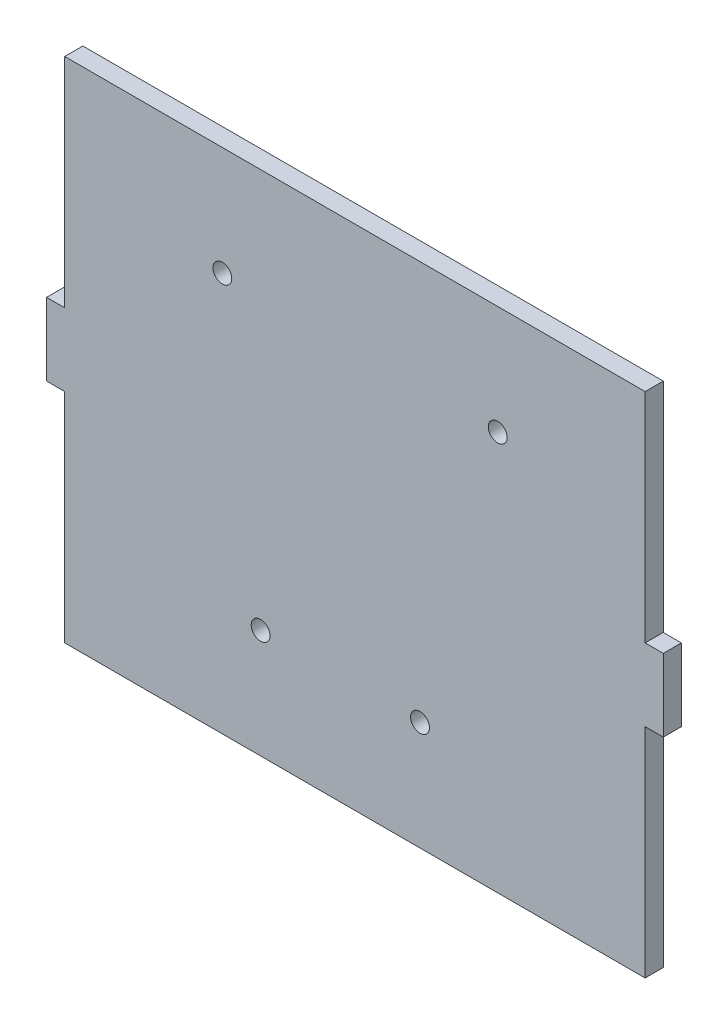
ISO-10303-21;
HEADER;
FILE_DESCRIPTION(('STEP AP214'),'2;1');
FILE_NAME('part.step','',(''),(''),'','','');
FILE_SCHEMA(('AUTOMOTIVE_DESIGN { 1 0 10303 214 1 1 1 1 }'));
ENDSEC;
DATA;
#1=APPLICATION_CONTEXT('core data for automotive mechanical design processes');
#2=APPLICATION_PROTOCOL_DEFINITION('international standard','automotive_design',2000,#1);
#3=PRODUCT_CONTEXT('',#1,'mechanical');
#4=PRODUCT('Part','Part','',(#3));
#5=PRODUCT_RELATED_PRODUCT_CATEGORY('part','',(#4));
#6=PRODUCT_DEFINITION_FORMATION('','',#4);
#7=PRODUCT_DEFINITION_CONTEXT('part definition',#1,'design');
#8=PRODUCT_DEFINITION('design','',#6,#7);
#9=PRODUCT_DEFINITION_SHAPE('','',#8);
#10=(LENGTH_UNIT() NAMED_UNIT(*) SI_UNIT(.MILLI.,.METRE.));
#11=(NAMED_UNIT(*) PLANE_ANGLE_UNIT() SI_UNIT($,.RADIAN.));
#12=(NAMED_UNIT(*) SI_UNIT($,.STERADIAN.) SOLID_ANGLE_UNIT());
#13=UNCERTAINTY_MEASURE_WITH_UNIT(LENGTH_MEASURE(1.E-05),#10,'distance_accuracy_value','');
#14=(GEOMETRIC_REPRESENTATION_CONTEXT(3) GLOBAL_UNCERTAINTY_ASSIGNED_CONTEXT((#13)) GLOBAL_UNIT_ASSIGNED_CONTEXT((#10,
#11,#12)) REPRESENTATION_CONTEXT('',''));
#15=CARTESIAN_POINT('',(0.,0.,0.));
#16=DIRECTION('',(0.,0.,1.));
#17=DIRECTION('',(1.,0.,0.));
#18=AXIS2_PLACEMENT_3D('',#15,#16,#17);
#19=CARTESIAN_POINT('',(101.6,0.,3.175));
#20=DIRECTION('',(-1.,0.,0.));
#21=DIRECTION('',(0.,0.,1.));
#22=AXIS2_PLACEMENT_3D('',#19,#20,#21);
#23=PLANE('',#22);
#24=DIRECTION('',(0.,0.,1.));
#25=VECTOR('',#24,1.);
#26=CARTESIAN_POINT('',(101.6,50.8,0.));
#27=LINE('',#26,#25);
#28=CARTESIAN_POINT('',(101.6,50.8,0.));
#29=VERTEX_POINT('',#28);
#30=CARTESIAN_POINT('',(101.6,50.8,3.175));
#31=VERTEX_POINT('',#30);
#32=EDGE_CURVE('E132',#29,#31,#27,.T.);
#33=ORIENTED_EDGE('',*,*,#32,.F.);
#34=DIRECTION('',(0.,1.,0.));
#35=VECTOR('',#34,1.);
#36=CARTESIAN_POINT('',(101.6,0.,0.));
#37=LINE('',#36,#35);
#38=CARTESIAN_POINT('',(101.6,88.9,0.));
#39=VERTEX_POINT('',#38);
#40=EDGE_CURVE('E146',#29,#39,#37,.T.);
#41=ORIENTED_EDGE('',*,*,#40,.T.);
#42=DIRECTION('',(0.,0.,-1.));
#43=VECTOR('',#42,1.);
#44=CARTESIAN_POINT('',(101.6,88.9,3.175));
#45=LINE('',#44,#43);
#46=CARTESIAN_POINT('',(101.6,88.9,3.175));
#47=VERTEX_POINT('',#46);
#48=EDGE_CURVE('E175',#47,#39,#45,.T.);
#49=ORIENTED_EDGE('',*,*,#48,.F.);
#50=DIRECTION('',(0.,1.,0.));
#51=VECTOR('',#50,1.);
#52=CARTESIAN_POINT('',(101.6,0.,3.175));
#53=LINE('',#52,#51);
#54=EDGE_CURVE('E148',#31,#47,#53,.T.);
#55=ORIENTED_EDGE('',*,*,#54,.F.);
#56=EDGE_LOOP('',(#33,#41,#49,#55));
#57=FACE_BOUND('',#56,.T.);
#58=ADVANCED_FACE('F39',(#57),#23,.F.);
#59=CARTESIAN_POINT('',(0.,0.,3.175));
#60=DIRECTION('',(1.,0.,0.));
#61=DIRECTION('',(0.,1.,0.));
#62=AXIS2_PLACEMENT_3D('',#59,#60,#61);
#63=PLANE('',#62);
#64=DIRECTION('',(0.,0.,1.));
#65=VECTOR('',#64,1.);
#66=CARTESIAN_POINT('',(0.,38.1,0.));
#67=LINE('',#66,#65);
#68=CARTESIAN_POINT('',(0.,38.1,0.));
#69=VERTEX_POINT('',#68);
#70=CARTESIAN_POINT('',(0.,38.1,3.175));
#71=VERTEX_POINT('',#70);
#72=EDGE_CURVE('E237',#69,#71,#67,.T.);
#73=ORIENTED_EDGE('',*,*,#72,.F.);
#74=DIRECTION('',(0.,-1.,0.));
#75=VECTOR('',#74,1.);
#76=CARTESIAN_POINT('',(0.,0.,0.));
#77=LINE('',#76,#75);
#78=CARTESIAN_POINT('',(0.,0.,0.));
#79=VERTEX_POINT('',#78);
#80=EDGE_CURVE('E240',#69,#79,#77,.T.);
#81=ORIENTED_EDGE('',*,*,#80,.T.);
#82=DIRECTION('',(0.,0.,-1.));
#83=VECTOR('',#82,1.);
#84=CARTESIAN_POINT('',(0.,0.,3.175));
#85=LINE('',#84,#83);
#86=CARTESIAN_POINT('',(0.,0.,3.175));
#87=VERTEX_POINT('',#86);
#88=EDGE_CURVE('E11',#87,#79,#85,.T.);
#89=ORIENTED_EDGE('',*,*,#88,.F.);
#90=DIRECTION('',(0.,-1.,0.));
#91=VECTOR('',#90,1.);
#92=CARTESIAN_POINT('',(0.,0.,3.175));
#93=LINE('',#92,#91);
#94=EDGE_CURVE('E170',#71,#87,#93,.T.);
#95=ORIENTED_EDGE('',*,*,#94,.F.);
#96=EDGE_LOOP('',(#73,#81,#89,#95));
#97=FACE_BOUND('',#96,.T.);
#98=ADVANCED_FACE('F266',(#97),#63,.F.);
#99=CARTESIAN_POINT('',(0.,88.9,0.));
#100=VERTEX_POINT('',#99);
#101=CARTESIAN_POINT('',(0.,50.8,0.));
#102=VERTEX_POINT('',#101);
#103=EDGE_CURVE('E164',#100,#102,#77,.T.);
#104=ORIENTED_EDGE('',*,*,#103,.T.);
#105=DIRECTION('',(0.,0.,1.));
#106=VECTOR('',#105,1.);
#107=CARTESIAN_POINT('',(0.,50.8,0.));
#108=LINE('',#107,#106);
#109=CARTESIAN_POINT('',(0.,50.8,3.175));
#110=VERTEX_POINT('',#109);
#111=EDGE_CURVE('E227',#102,#110,#108,.T.);
#112=ORIENTED_EDGE('',*,*,#111,.T.);
#113=CARTESIAN_POINT('',(0.,88.9,3.175));
#114=VERTEX_POINT('',#113);
#115=EDGE_CURVE('E249',#114,#110,#93,.T.);
#116=ORIENTED_EDGE('',*,*,#115,.F.);
#117=DIRECTION('',(0.,0.,-1.));
#118=VECTOR('',#117,1.);
#119=CARTESIAN_POINT('',(0.,88.9,3.175));
#120=LINE('',#119,#118);
#121=EDGE_CURVE('E171',#114,#100,#120,.T.);
#122=ORIENTED_EDGE('',*,*,#121,.T.);
#123=EDGE_LOOP('',(#104,#112,#116,#122));
#124=FACE_BOUND('',#123,.T.);
#125=ADVANCED_FACE('F41',(#124),#63,.F.);
#126=CARTESIAN_POINT('',(0.,0.,3.175));
#127=DIRECTION('',(0.,1.,0.));
#128=DIRECTION('',(0.,0.,1.));
#129=AXIS2_PLACEMENT_3D('',#126,#127,#128);
#130=PLANE('',#129);
#131=DIRECTION('',(1.,0.,0.));
#132=VECTOR('',#131,1.);
#133=CARTESIAN_POINT('',(0.,0.,0.));
#134=LINE('',#133,#132);
#135=CARTESIAN_POINT('',(101.6,0.,0.));
#136=VERTEX_POINT('',#135);
#137=EDGE_CURVE('E159',#79,#136,#134,.T.);
#138=ORIENTED_EDGE('',*,*,#137,.T.);
#139=DIRECTION('',(0.,0.,-1.));
#140=VECTOR('',#139,1.);
#141=CARTESIAN_POINT('',(101.6,0.,3.175));
#142=LINE('',#141,#140);
#143=CARTESIAN_POINT('',(101.6,0.,3.175));
#144=VERTEX_POINT('',#143);
#145=EDGE_CURVE('E48',#144,#136,#142,.T.);
#146=ORIENTED_EDGE('',*,*,#145,.F.);
#147=DIRECTION('',(1.,0.,0.));
#148=VECTOR('',#147,1.);
#149=CARTESIAN_POINT('',(0.,0.,3.175));
#150=LINE('',#149,#148);
#151=EDGE_CURVE('E253',#87,#144,#150,.T.);
#152=ORIENTED_EDGE('',*,*,#151,.F.);
#153=ORIENTED_EDGE('',*,*,#88,.T.);
#154=EDGE_LOOP('',(#138,#146,#152,#153));
#155=FACE_BOUND('',#154,.T.);
#156=ADVANCED_FACE('F293',(#155),#130,.F.);
#157=CARTESIAN_POINT('',(101.6,38.1,0.));
#158=VERTEX_POINT('',#157);
#159=EDGE_CURVE('E158',#136,#158,#37,.T.);
#160=ORIENTED_EDGE('',*,*,#159,.T.);
#161=DIRECTION('',(0.,0.,1.));
#162=VECTOR('',#161,1.);
#163=CARTESIAN_POINT('',(101.6,38.1,0.));
#164=LINE('',#163,#162);
#165=CARTESIAN_POINT('',(101.6,38.1,3.175));
#166=VERTEX_POINT('',#165);
#167=EDGE_CURVE('E150',#158,#166,#164,.T.);
#168=ORIENTED_EDGE('',*,*,#167,.T.);
#169=EDGE_CURVE('E186',#144,#166,#53,.T.);
#170=ORIENTED_EDGE('',*,*,#169,.F.);
#171=ORIENTED_EDGE('',*,*,#145,.T.);
#172=EDGE_LOOP('',(#160,#168,#170,#171));
#173=FACE_BOUND('',#172,.T.);
#174=ADVANCED_FACE('F184',(#173),#23,.F.);
#175=CARTESIAN_POINT('',(0.,88.9,3.175));
#176=DIRECTION('',(0.,-1.,0.));
#177=DIRECTION('',(0.,0.,-1.));
#178=AXIS2_PLACEMENT_3D('',#175,#176,#177);
#179=PLANE('',#178);
#180=DIRECTION('',(-1.,0.,0.));
#181=VECTOR('',#180,1.);
#182=CARTESIAN_POINT('',(0.,88.9,0.));
#183=LINE('',#182,#181);
#184=EDGE_CURVE('E156',#39,#100,#183,.T.);
#185=ORIENTED_EDGE('',*,*,#184,.T.);
#186=ORIENTED_EDGE('',*,*,#121,.F.);
#187=DIRECTION('',(-1.,0.,0.));
#188=VECTOR('',#187,1.);
#189=CARTESIAN_POINT('',(0.,88.9,3.175));
#190=LINE('',#189,#188);
#191=EDGE_CURVE('E176',#47,#114,#190,.T.);
#192=ORIENTED_EDGE('',*,*,#191,.F.);
#193=ORIENTED_EDGE('',*,*,#48,.T.);
#194=EDGE_LOOP('',(#185,#186,#192,#193));
#195=FACE_BOUND('',#194,.T.);
#196=ADVANCED_FACE('F284',(#195),#179,.F.);
#197=CARTESIAN_POINT('',(0.,0.,3.175));
#198=DIRECTION('',(0.,0.,-1.));
#199=DIRECTION('',(-1.,0.,0.));
#200=AXIS2_PLACEMENT_3D('',#197,#198,#199);
#201=PLANE('',#200);
#202=CARTESIAN_POINT('',(27.589999938,69.85,3.175));
#203=DIRECTION('',(0.,0.,1.));
#204=DIRECTION('',(1.,0.,0.));
#205=AXIS2_PLACEMENT_3D('',#202,#203,#204);
#206=CIRCLE('',#205,1.65);
#207=CARTESIAN_POINT('',(29.239999938,69.85,3.175));
#208=VERTEX_POINT('',#207);
#209=EDGE_CURVE('E365',#208,#208,#206,.T.);
#210=ORIENTED_EDGE('',*,*,#209,.F.);
#211=EDGE_LOOP('',(#210));
#212=FACE_BOUND('',#211,.T.);
#213=CARTESIAN_POINT('',(75.790000058,69.85,3.175));
#214=DIRECTION('',(0.,0.,1.));
#215=DIRECTION('',(1.,0.,0.));
#216=AXIS2_PLACEMENT_3D('',#213,#214,#215);
#217=CIRCLE('',#216,1.65);
#218=CARTESIAN_POINT('',(77.440000058,69.85,3.175));
#219=VERTEX_POINT('',#218);
#220=EDGE_CURVE('E359',#219,#219,#217,.T.);
#221=ORIENTED_EDGE('',*,*,#220,.F.);
#222=EDGE_LOOP('',(#221));
#223=FACE_BOUND('',#222,.T.);
#224=CARTESIAN_POINT('',(62.19000008,19.05,3.175));
#225=DIRECTION('',(0.,0.,1.));
#226=DIRECTION('',(1.,0.,0.));
#227=AXIS2_PLACEMENT_3D('',#224,#225,#226);
#228=CIRCLE('',#227,1.65);
#229=CARTESIAN_POINT('',(63.84000008,19.05,3.175));
#230=VERTEX_POINT('',#229);
#231=EDGE_CURVE('E348',#230,#230,#228,.T.);
#232=ORIENTED_EDGE('',*,*,#231,.F.);
#233=EDGE_LOOP('',(#232));
#234=FACE_BOUND('',#233,.T.);
#235=CARTESIAN_POINT('',(34.29,19.05,3.175));
#236=DIRECTION('',(0.,0.,1.));
#237=DIRECTION('',(1.,0.,0.));
#238=AXIS2_PLACEMENT_3D('',#235,#236,#237);
#239=CIRCLE('',#238,1.65);
#240=CARTESIAN_POINT('',(35.94,19.05,3.175));
#241=VERTEX_POINT('',#240);
#242=EDGE_CURVE('E349',#241,#241,#239,.T.);
#243=ORIENTED_EDGE('',*,*,#242,.F.);
#244=EDGE_LOOP('',(#243));
#245=FACE_BOUND('',#244,.T.);
#246=ORIENTED_EDGE('',*,*,#115,.T.);
#247=DIRECTION('',(-1.,0.,0.));
#248=VECTOR('',#247,1.);
#249=CARTESIAN_POINT('',(0.,50.8,3.175));
#250=LINE('',#249,#248);
#251=CARTESIAN_POINT('',(-3.17499999999999,50.8,3.175));
#252=VERTEX_POINT('',#251);
#253=EDGE_CURVE('E63',#110,#252,#250,.T.);
#254=ORIENTED_EDGE('',*,*,#253,.T.);
#255=DIRECTION('',(0.,-1.,0.));
#256=VECTOR('',#255,1.);
#257=CARTESIAN_POINT('',(-3.17499999999999,50.8,3.175));
#258=LINE('',#257,#256);
#259=CARTESIAN_POINT('',(-3.175,38.1,3.175));
#260=VERTEX_POINT('',#259);
#261=EDGE_CURVE('E230',#252,#260,#258,.T.);
#262=ORIENTED_EDGE('',*,*,#261,.T.);
#263=DIRECTION('',(1.,0.,0.));
#264=VECTOR('',#263,1.);
#265=CARTESIAN_POINT('',(0.,38.1,3.175));
#266=LINE('',#265,#264);
#267=EDGE_CURVE('E220',#260,#71,#266,.T.);
#268=ORIENTED_EDGE('',*,*,#267,.T.);
#269=ORIENTED_EDGE('',*,*,#94,.T.);
#270=ORIENTED_EDGE('',*,*,#151,.T.);
#271=ORIENTED_EDGE('',*,*,#169,.T.);
#272=DIRECTION('',(1.,0.,0.));
#273=VECTOR('',#272,1.);
#274=CARTESIAN_POINT('',(101.6,38.1,3.175));
#275=LINE('',#274,#273);
#276=CARTESIAN_POINT('',(104.775,38.1,3.175));
#277=VERTEX_POINT('',#276);
#278=EDGE_CURVE('E55',#166,#277,#275,.T.);
#279=ORIENTED_EDGE('',*,*,#278,.T.);
#280=DIRECTION('',(0.,1.,0.));
#281=VECTOR('',#280,1.);
#282=CARTESIAN_POINT('',(104.775,50.8,3.175));
#283=LINE('',#282,#281);
#284=CARTESIAN_POINT('',(104.775,50.8,3.175));
#285=VERTEX_POINT('',#284);
#286=EDGE_CURVE('E141',#277,#285,#283,.T.);
#287=ORIENTED_EDGE('',*,*,#286,.T.);
#288=DIRECTION('',(-1.,0.,0.));
#289=VECTOR('',#288,1.);
#290=CARTESIAN_POINT('',(101.6,50.8,3.175));
#291=LINE('',#290,#289);
#292=EDGE_CURVE('E199',#285,#31,#291,.T.);
#293=ORIENTED_EDGE('',*,*,#292,.T.);
#294=ORIENTED_EDGE('',*,*,#54,.T.);
#295=ORIENTED_EDGE('',*,*,#191,.T.);
#296=EDGE_LOOP('',(#246,#254,#262,#268,#269,#270,#271,#279,#287,#293,#294,#295));
#297=FACE_BOUND('',#296,.T.);
#298=ADVANCED_FACE('F280',(#212,#223,#234,#245,#297),#201,.F.);
#299=CARTESIAN_POINT('',(0.,0.,0.));
#300=DIRECTION('',(0.,0.,-1.));
#301=DIRECTION('',(-1.,0.,0.));
#302=AXIS2_PLACEMENT_3D('',#299,#300,#301);
#303=PLANE('',#302);
#304=CARTESIAN_POINT('',(27.589999938,69.85,0.));
#305=DIRECTION('',(0.,0.,1.));
#306=DIRECTION('',(1.,0.,0.));
#307=AXIS2_PLACEMENT_3D('',#304,#305,#306);
#308=CIRCLE('',#307,1.65);
#309=CARTESIAN_POINT('',(29.239999938,69.85,0.));
#310=VERTEX_POINT('',#309);
#311=EDGE_CURVE('E202',#310,#310,#308,.T.);
#312=ORIENTED_EDGE('',*,*,#311,.T.);
#313=EDGE_LOOP('',(#312));
#314=FACE_BOUND('',#313,.T.);
#315=CARTESIAN_POINT('',(75.790000058,69.85,0.));
#316=DIRECTION('',(0.,0.,1.));
#317=DIRECTION('',(1.,0.,0.));
#318=AXIS2_PLACEMENT_3D('',#315,#316,#317);
#319=CIRCLE('',#318,1.65);
#320=CARTESIAN_POINT('',(77.440000058,69.85,0.));
#321=VERTEX_POINT('',#320);
#322=EDGE_CURVE('E339',#321,#321,#319,.T.);
#323=ORIENTED_EDGE('',*,*,#322,.T.);
#324=EDGE_LOOP('',(#323));
#325=FACE_BOUND('',#324,.T.);
#326=CARTESIAN_POINT('',(62.19000008,19.05,0.));
#327=DIRECTION('',(0.,0.,1.));
#328=DIRECTION('',(1.,0.,0.));
#329=AXIS2_PLACEMENT_3D('',#326,#327,#328);
#330=CIRCLE('',#329,1.65);
#331=CARTESIAN_POINT('',(63.84000008,19.05,0.));
#332=VERTEX_POINT('',#331);
#333=EDGE_CURVE('E343',#332,#332,#330,.T.);
#334=ORIENTED_EDGE('',*,*,#333,.T.);
#335=EDGE_LOOP('',(#334));
#336=FACE_BOUND('',#335,.T.);
#337=CARTESIAN_POINT('',(34.29,19.05,0.));
#338=DIRECTION('',(0.,0.,1.));
#339=DIRECTION('',(1.,0.,0.));
#340=AXIS2_PLACEMENT_3D('',#337,#338,#339);
#341=CIRCLE('',#340,1.65);
#342=CARTESIAN_POINT('',(35.94,19.05,0.));
#343=VERTEX_POINT('',#342);
#344=EDGE_CURVE('E346',#343,#343,#341,.T.);
#345=ORIENTED_EDGE('',*,*,#344,.T.);
#346=EDGE_LOOP('',(#345));
#347=FACE_BOUND('',#346,.T.);
#348=ORIENTED_EDGE('',*,*,#103,.F.);
#349=ORIENTED_EDGE('',*,*,#184,.F.);
#350=ORIENTED_EDGE('',*,*,#40,.F.);
#351=DIRECTION('',(-1.,0.,0.));
#352=VECTOR('',#351,1.);
#353=CARTESIAN_POINT('',(101.6,50.8,0.));
#354=LINE('',#353,#352);
#355=CARTESIAN_POINT('',(104.775,50.8,0.));
#356=VERTEX_POINT('',#355);
#357=EDGE_CURVE('E128',#356,#29,#354,.T.);
#358=ORIENTED_EDGE('',*,*,#357,.F.);
#359=DIRECTION('',(0.,1.,0.));
#360=VECTOR('',#359,1.);
#361=CARTESIAN_POINT('',(104.775,50.8,0.));
#362=LINE('',#361,#360);
#363=CARTESIAN_POINT('',(104.775,38.1,0.));
#364=VERTEX_POINT('',#363);
#365=EDGE_CURVE('E151',#364,#356,#362,.T.);
#366=ORIENTED_EDGE('',*,*,#365,.F.);
#367=DIRECTION('',(1.,0.,0.));
#368=VECTOR('',#367,1.);
#369=CARTESIAN_POINT('',(101.6,38.1,0.));
#370=LINE('',#369,#368);
#371=EDGE_CURVE('E140',#158,#364,#370,.T.);
#372=ORIENTED_EDGE('',*,*,#371,.F.);
#373=ORIENTED_EDGE('',*,*,#159,.F.);
#374=ORIENTED_EDGE('',*,*,#137,.F.);
#375=ORIENTED_EDGE('',*,*,#80,.F.);
#376=DIRECTION('',(1.,0.,0.));
#377=VECTOR('',#376,1.);
#378=CARTESIAN_POINT('',(0.,38.1,0.));
#379=LINE('',#378,#377);
#380=CARTESIAN_POINT('',(-3.175,38.1,0.));
#381=VERTEX_POINT('',#380);
#382=EDGE_CURVE('E224',#381,#69,#379,.T.);
#383=ORIENTED_EDGE('',*,*,#382,.F.);
#384=DIRECTION('',(0.,-1.,0.));
#385=VECTOR('',#384,1.);
#386=CARTESIAN_POINT('',(-3.17499999999999,50.8,0.));
#387=LINE('',#386,#385);
#388=CARTESIAN_POINT('',(-3.17499999999999,50.8,0.));
#389=VERTEX_POINT('',#388);
#390=EDGE_CURVE('E219',#389,#381,#387,.T.);
#391=ORIENTED_EDGE('',*,*,#390,.F.);
#392=DIRECTION('',(-1.,0.,0.));
#393=VECTOR('',#392,1.);
#394=CARTESIAN_POINT('',(0.,50.8,0.));
#395=LINE('',#394,#393);
#396=EDGE_CURVE('E215',#102,#389,#395,.T.);
#397=ORIENTED_EDGE('',*,*,#396,.F.);
#398=EDGE_LOOP('',(#348,#349,#350,#358,#366,#372,#373,#374,#375,#383,#391,#397));
#399=FACE_BOUND('',#398,.T.);
#400=ADVANCED_FACE('F155',(#314,#325,#336,#347,#399),#303,.T.);
#401=CARTESIAN_POINT('',(0.,38.1,0.));
#402=DIRECTION('',(0.,-1.,0.));
#403=DIRECTION('',(0.,0.,-1.));
#404=AXIS2_PLACEMENT_3D('',#401,#402,#403);
#405=PLANE('',#404);
#406=ORIENTED_EDGE('',*,*,#267,.F.);
#407=DIRECTION('',(0.,0.,1.));
#408=VECTOR('',#407,1.);
#409=CARTESIAN_POINT('',(-3.175,38.1,0.));
#410=LINE('',#409,#408);
#411=EDGE_CURVE('E241',#381,#260,#410,.T.);
#412=ORIENTED_EDGE('',*,*,#411,.F.);
#413=ORIENTED_EDGE('',*,*,#382,.T.);
#414=ORIENTED_EDGE('',*,*,#72,.T.);
#415=EDGE_LOOP('',(#406,#412,#413,#414));
#416=FACE_BOUND('',#415,.T.);
#417=ADVANCED_FACE('F273',(#416),#405,.T.);
#418=CARTESIAN_POINT('',(-3.17499999999999,50.8,0.));
#419=DIRECTION('',(-1.,0.,0.));
#420=DIRECTION('',(0.,-1.,0.));
#421=AXIS2_PLACEMENT_3D('',#418,#419,#420);
#422=PLANE('',#421);
#423=ORIENTED_EDGE('',*,*,#261,.F.);
#424=DIRECTION('',(0.,0.,1.));
#425=VECTOR('',#424,1.);
#426=CARTESIAN_POINT('',(-3.17499999999999,50.8,0.));
#427=LINE('',#426,#425);
#428=EDGE_CURVE('E244',#389,#252,#427,.T.);
#429=ORIENTED_EDGE('',*,*,#428,.F.);
#430=ORIENTED_EDGE('',*,*,#390,.T.);
#431=ORIENTED_EDGE('',*,*,#411,.T.);
#432=EDGE_LOOP('',(#423,#429,#430,#431));
#433=FACE_BOUND('',#432,.T.);
#434=ADVANCED_FACE('F276',(#433),#422,.T.);
#435=CARTESIAN_POINT('',(0.,50.8,0.));
#436=DIRECTION('',(0.,1.,0.));
#437=DIRECTION('',(0.,0.,1.));
#438=AXIS2_PLACEMENT_3D('',#435,#436,#437);
#439=PLANE('',#438);
#440=ORIENTED_EDGE('',*,*,#253,.F.);
#441=ORIENTED_EDGE('',*,*,#111,.F.);
#442=ORIENTED_EDGE('',*,*,#396,.T.);
#443=ORIENTED_EDGE('',*,*,#428,.T.);
#444=EDGE_LOOP('',(#440,#441,#442,#443));
#445=FACE_BOUND('',#444,.T.);
#446=ADVANCED_FACE('F277',(#445),#439,.T.);
#447=CARTESIAN_POINT('',(101.6,50.8,0.));
#448=DIRECTION('',(0.,1.,0.));
#449=DIRECTION('',(0.,0.,1.));
#450=AXIS2_PLACEMENT_3D('',#447,#448,#449);
#451=PLANE('',#450);
#452=ORIENTED_EDGE('',*,*,#292,.F.);
#453=DIRECTION('',(0.,0.,1.));
#454=VECTOR('',#453,1.);
#455=CARTESIAN_POINT('',(104.775,50.8,0.));
#456=LINE('',#455,#454);
#457=EDGE_CURVE('E134',#356,#285,#456,.T.);
#458=ORIENTED_EDGE('',*,*,#457,.F.);
#459=ORIENTED_EDGE('',*,*,#357,.T.);
#460=ORIENTED_EDGE('',*,*,#32,.T.);
#461=EDGE_LOOP('',(#452,#458,#459,#460));
#462=FACE_BOUND('',#461,.T.);
#463=ADVANCED_FACE('F131',(#462),#451,.T.);
#464=CARTESIAN_POINT('',(104.775,50.8,0.));
#465=DIRECTION('',(1.,0.,0.));
#466=DIRECTION('',(0.,0.,-1.));
#467=AXIS2_PLACEMENT_3D('',#464,#465,#466);
#468=PLANE('',#467);
#469=ORIENTED_EDGE('',*,*,#286,.F.);
#470=DIRECTION('',(0.,0.,1.));
#471=VECTOR('',#470,1.);
#472=CARTESIAN_POINT('',(104.775,38.1,0.));
#473=LINE('',#472,#471);
#474=EDGE_CURVE('E210',#364,#277,#473,.T.);
#475=ORIENTED_EDGE('',*,*,#474,.F.);
#476=ORIENTED_EDGE('',*,*,#365,.T.);
#477=ORIENTED_EDGE('',*,*,#457,.T.);
#478=EDGE_LOOP('',(#469,#475,#476,#477));
#479=FACE_BOUND('',#478,.T.);
#480=ADVANCED_FACE('F308',(#479),#468,.T.);
#481=CARTESIAN_POINT('',(101.6,38.1,0.));
#482=DIRECTION('',(0.,-1.,0.));
#483=DIRECTION('',(0.,0.,-1.));
#484=AXIS2_PLACEMENT_3D('',#481,#482,#483);
#485=PLANE('',#484);
#486=ORIENTED_EDGE('',*,*,#278,.F.);
#487=ORIENTED_EDGE('',*,*,#167,.F.);
#488=ORIENTED_EDGE('',*,*,#371,.T.);
#489=ORIENTED_EDGE('',*,*,#474,.T.);
#490=EDGE_LOOP('',(#486,#487,#488,#489));
#491=FACE_BOUND('',#490,.T.);
#492=ADVANCED_FACE('F309',(#491),#485,.T.);
#493=CARTESIAN_POINT('',(34.29,19.05,0.));
#494=DIRECTION('',(0.,0.,1.));
#495=DIRECTION('',(1.,0.,0.));
#496=AXIS2_PLACEMENT_3D('',#493,#494,#495);
#497=CYLINDRICAL_SURFACE('',#496,1.65);
#498=ORIENTED_EDGE('',*,*,#344,.F.);
#499=EDGE_LOOP('',(#498));
#500=FACE_BOUND('',#499,.T.);
#501=ORIENTED_EDGE('',*,*,#242,.T.);
#502=EDGE_LOOP('',(#501));
#503=FACE_BOUND('',#502,.T.);
#504=ADVANCED_FACE('F311',(#500,#503),#497,.F.);
#505=CARTESIAN_POINT('',(62.19000008,19.05,0.));
#506=DIRECTION('',(0.,0.,1.));
#507=DIRECTION('',(1.,0.,0.));
#508=AXIS2_PLACEMENT_3D('',#505,#506,#507);
#509=CYLINDRICAL_SURFACE('',#508,1.65);
#510=ORIENTED_EDGE('',*,*,#333,.F.);
#511=EDGE_LOOP('',(#510));
#512=FACE_BOUND('',#511,.T.);
#513=ORIENTED_EDGE('',*,*,#231,.T.);
#514=EDGE_LOOP('',(#513));
#515=FACE_BOUND('',#514,.T.);
#516=ADVANCED_FACE('F317',(#512,#515),#509,.F.);
#517=CARTESIAN_POINT('',(75.790000058,69.85,0.));
#518=DIRECTION('',(0.,0.,1.));
#519=DIRECTION('',(1.,0.,0.));
#520=AXIS2_PLACEMENT_3D('',#517,#518,#519);
#521=CYLINDRICAL_SURFACE('',#520,1.65);
#522=ORIENTED_EDGE('',*,*,#322,.F.);
#523=EDGE_LOOP('',(#522));
#524=FACE_BOUND('',#523,.T.);
#525=ORIENTED_EDGE('',*,*,#220,.T.);
#526=EDGE_LOOP('',(#525));
#527=FACE_BOUND('',#526,.T.);
#528=ADVANCED_FACE('F382',(#524,#527),#521,.F.);
#529=CARTESIAN_POINT('',(27.589999938,69.85,0.));
#530=DIRECTION('',(0.,0.,1.));
#531=DIRECTION('',(1.,0.,0.));
#532=AXIS2_PLACEMENT_3D('',#529,#530,#531);
#533=CYLINDRICAL_SURFACE('',#532,1.65);
#534=ORIENTED_EDGE('',*,*,#311,.F.);
#535=EDGE_LOOP('',(#534));
#536=FACE_BOUND('',#535,.T.);
#537=ORIENTED_EDGE('',*,*,#209,.T.);
#538=EDGE_LOOP('',(#537));
#539=FACE_BOUND('',#538,.T.);
#540=ADVANCED_FACE('F372',(#536,#539),#533,.F.);
#541=CLOSED_SHELL('',(#58,#98,#125,#156,#174,#196,#298,#400,#417,#434,#446,#463,#480,#492,#504,
#516,#528,#540));
#542=MANIFOLD_SOLID_BREP('B2',#541);
#543=ADVANCED_BREP_SHAPE_REPRESENTATION('',(#18,#542),#14);
#544=SHAPE_DEFINITION_REPRESENTATION(#9,#543);
ENDSEC;
END-ISO-10303-21;
